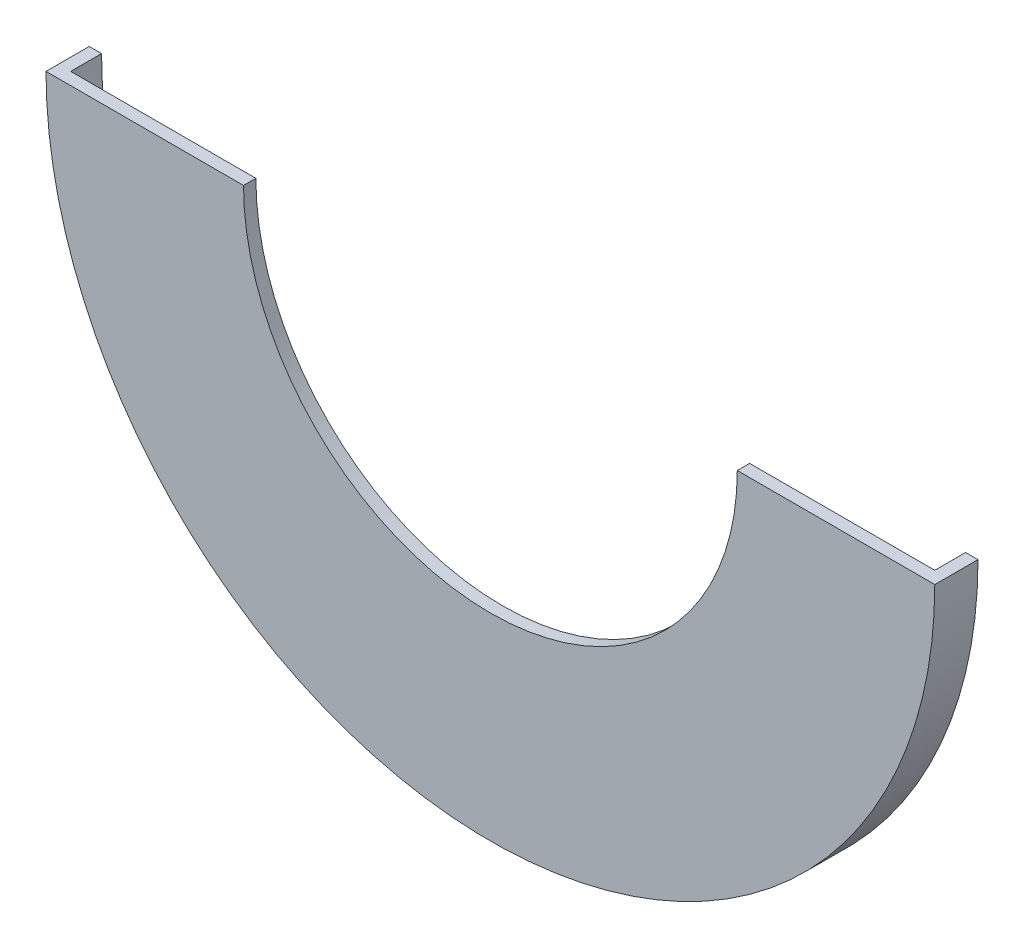
ISO-10303-21;
HEADER;
FILE_DESCRIPTION(('STEP AP214'),'2;1');
FILE_NAME('part.step','',(''),(''),'','','');
FILE_SCHEMA(('AUTOMOTIVE_DESIGN { 1 0 10303 214 1 1 1 1 }'));
ENDSEC;
DATA;
#1=APPLICATION_CONTEXT('core data for automotive mechanical design processes');
#2=APPLICATION_PROTOCOL_DEFINITION('international standard','automotive_design',2000,#1);
#3=PRODUCT_CONTEXT('',#1,'mechanical');
#4=PRODUCT('Part','Part','',(#3));
#5=PRODUCT_RELATED_PRODUCT_CATEGORY('part','',(#4));
#6=PRODUCT_DEFINITION_FORMATION('','',#4);
#7=PRODUCT_DEFINITION_CONTEXT('part definition',#1,'design');
#8=PRODUCT_DEFINITION('design','',#6,#7);
#9=PRODUCT_DEFINITION_SHAPE('','',#8);
#10=(LENGTH_UNIT() NAMED_UNIT(*) SI_UNIT(.MILLI.,.METRE.));
#11=(NAMED_UNIT(*) PLANE_ANGLE_UNIT() SI_UNIT($,.RADIAN.));
#12=(NAMED_UNIT(*) SI_UNIT($,.STERADIAN.) SOLID_ANGLE_UNIT());
#13=UNCERTAINTY_MEASURE_WITH_UNIT(LENGTH_MEASURE(1.E-05),#10,'distance_accuracy_value','');
#14=(GEOMETRIC_REPRESENTATION_CONTEXT(3) GLOBAL_UNCERTAINTY_ASSIGNED_CONTEXT((#13)) GLOBAL_UNIT_ASSIGNED_CONTEXT((#10,
#11,#12)) REPRESENTATION_CONTEXT('',''));
#15=CARTESIAN_POINT('',(0.,0.,0.));
#16=DIRECTION('',(0.,0.,1.));
#17=DIRECTION('',(1.,0.,0.));
#18=AXIS2_PLACEMENT_3D('',#15,#16,#17);
#19=CARTESIAN_POINT('',(0.,0.,5.));
#20=DIRECTION('',(0.,0.,-1.));
#21=DIRECTION('',(-1.,0.,0.));
#22=AXIS2_PLACEMENT_3D('',#19,#20,#21);
#23=CYLINDRICAL_SURFACE('',#22,70.);
#24=CARTESIAN_POINT('',(0.,0.,0.));
#25=DIRECTION('',(0.,0.,1.));
#26=DIRECTION('',(1.,0.,0.));
#27=AXIS2_PLACEMENT_3D('',#24,#25,#26);
#28=CIRCLE('',#27,70.);
#29=CARTESIAN_POINT('',(-70.,0.,0.));
#30=VERTEX_POINT('',#29);
#31=CARTESIAN_POINT('',(70.,0.,0.));
#32=VERTEX_POINT('',#31);
#33=EDGE_CURVE('E97',#30,#32,#28,.T.);
#34=ORIENTED_EDGE('',*,*,#33,.F.);
#35=DIRECTION('',(0.,0.,-1.));
#36=VECTOR('',#35,1.);
#37=CARTESIAN_POINT('',(-70.,0.,5.));
#38=LINE('',#37,#36);
#39=CARTESIAN_POINT('',(-70.,0.,5.));
#40=VERTEX_POINT('',#39);
#41=EDGE_CURVE('E11',#40,#30,#38,.T.);
#42=ORIENTED_EDGE('',*,*,#41,.F.);
#43=CARTESIAN_POINT('',(0.,0.,5.));
#44=DIRECTION('',(0.,0.,1.));
#45=DIRECTION('',(1.,0.,0.));
#46=AXIS2_PLACEMENT_3D('',#43,#44,#45);
#47=CIRCLE('',#46,70.);
#48=CARTESIAN_POINT('',(70.,0.,5.));
#49=VERTEX_POINT('',#48);
#50=EDGE_CURVE('E98',#40,#49,#47,.T.);
#51=ORIENTED_EDGE('',*,*,#50,.T.);
#52=DIRECTION('',(0.,0.,-1.));
#53=VECTOR('',#52,1.);
#54=CARTESIAN_POINT('',(70.,0.,5.));
#55=LINE('',#54,#53);
#56=EDGE_CURVE('E83',#49,#32,#55,.T.);
#57=ORIENTED_EDGE('',*,*,#56,.T.);
#58=EDGE_LOOP('',(#34,#42,#51,#57));
#59=FACE_BOUND('',#58,.T.);
#60=ADVANCED_FACE('F39',(#59),#23,.F.);
#61=CARTESIAN_POINT('',(0.,0.,5.));
#62=DIRECTION('',(0.,1.,0.));
#63=DIRECTION('',(-1.,0.,0.));
#64=AXIS2_PLACEMENT_3D('',#61,#62,#63);
#65=PLANE('',#64);
#66=DIRECTION('',(1.,0.,0.));
#67=VECTOR('',#66,1.);
#68=CARTESIAN_POINT('',(0.,0.,0.));
#69=LINE('',#68,#67);
#70=CARTESIAN_POINT('',(-72.,0.,0.));
#71=VERTEX_POINT('',#70);
#72=EDGE_CURVE('E92',#71,#30,#69,.T.);
#73=ORIENTED_EDGE('',*,*,#72,.F.);
#74=DIRECTION('',(0.,0.,-1.));
#75=VECTOR('',#74,1.);
#76=CARTESIAN_POINT('',(-72.,0.,5.));
#77=LINE('',#76,#75);
#78=CARTESIAN_POINT('',(-72.,0.,7.));
#79=VERTEX_POINT('',#78);
#80=EDGE_CURVE('E47',#79,#71,#77,.T.);
#81=ORIENTED_EDGE('',*,*,#80,.F.);
#82=DIRECTION('',(-1.,0.,0.));
#83=VECTOR('',#82,1.);
#84=CARTESIAN_POINT('',(0.,0.,7.));
#85=LINE('',#84,#83);
#86=CARTESIAN_POINT('',(-40.,0.,7.));
#87=VERTEX_POINT('',#86);
#88=EDGE_CURVE('E118',#87,#79,#85,.T.);
#89=ORIENTED_EDGE('',*,*,#88,.F.);
#90=DIRECTION('',(0.,0.,-1.));
#91=VECTOR('',#90,1.);
#92=CARTESIAN_POINT('',(-40.,0.,7.));
#93=LINE('',#92,#91);
#94=CARTESIAN_POINT('',(-40.,0.,5.));
#95=VERTEX_POINT('',#94);
#96=EDGE_CURVE('E105',#87,#95,#93,.T.);
#97=ORIENTED_EDGE('',*,*,#96,.T.);
#98=DIRECTION('',(-1.,0.,0.));
#99=VECTOR('',#98,1.);
#100=CARTESIAN_POINT('',(0.,0.,5.));
#101=LINE('',#100,#99);
#102=EDGE_CURVE('E111',#95,#40,#101,.T.);
#103=ORIENTED_EDGE('',*,*,#102,.T.);
#104=ORIENTED_EDGE('',*,*,#41,.T.);
#105=EDGE_LOOP('',(#73,#81,#89,#97,#103,#104));
#106=FACE_BOUND('',#105,.T.);
#107=ADVANCED_FACE('F141',(#106),#65,.T.);
#108=CARTESIAN_POINT('',(0.,0.,5.));
#109=DIRECTION('',(0.,0.,-1.));
#110=DIRECTION('',(-1.,0.,0.));
#111=AXIS2_PLACEMENT_3D('',#108,#109,#110);
#112=CYLINDRICAL_SURFACE('',#111,72.);
#113=CARTESIAN_POINT('',(0.,0.,0.));
#114=DIRECTION('',(0.,0.,1.));
#115=DIRECTION('',(1.,0.,0.));
#116=AXIS2_PLACEMENT_3D('',#113,#114,#115);
#117=CIRCLE('',#116,72.);
#118=CARTESIAN_POINT('',(72.,0.,0.));
#119=VERTEX_POINT('',#118);
#120=EDGE_CURVE('E86',#71,#119,#117,.T.);
#121=ORIENTED_EDGE('',*,*,#120,.T.);
#122=DIRECTION('',(0.,0.,-1.));
#123=VECTOR('',#122,1.);
#124=CARTESIAN_POINT('',(72.,0.,5.));
#125=LINE('',#124,#123);
#126=CARTESIAN_POINT('',(72.,0.,7.));
#127=VERTEX_POINT('',#126);
#128=EDGE_CURVE('E71',#127,#119,#125,.T.);
#129=ORIENTED_EDGE('',*,*,#128,.F.);
#130=CARTESIAN_POINT('',(0.,0.,7.));
#131=DIRECTION('',(0.,0.,1.));
#132=DIRECTION('',(1.,0.,0.));
#133=AXIS2_PLACEMENT_3D('',#130,#131,#132);
#134=CIRCLE('',#133,72.);
#135=EDGE_CURVE('E110',#79,#127,#134,.T.);
#136=ORIENTED_EDGE('',*,*,#135,.F.);
#137=ORIENTED_EDGE('',*,*,#80,.T.);
#138=EDGE_LOOP('',(#121,#129,#136,#137));
#139=FACE_BOUND('',#138,.T.);
#140=ADVANCED_FACE('F87',(#139),#112,.T.);
#141=EDGE_CURVE('E75',#32,#119,#69,.T.);
#142=ORIENTED_EDGE('',*,*,#141,.F.);
#143=ORIENTED_EDGE('',*,*,#56,.F.);
#144=DIRECTION('',(-1.,0.,0.));
#145=VECTOR('',#144,1.);
#146=CARTESIAN_POINT('',(0.,0.,5.));
#147=LINE('',#146,#145);
#148=CARTESIAN_POINT('',(40.,0.,5.));
#149=VERTEX_POINT('',#148);
#150=EDGE_CURVE('E54',#49,#149,#147,.T.);
#151=ORIENTED_EDGE('',*,*,#150,.T.);
#152=DIRECTION('',(0.,0.,-1.));
#153=VECTOR('',#152,1.);
#154=CARTESIAN_POINT('',(40.,0.,7.));
#155=LINE('',#154,#153);
#156=CARTESIAN_POINT('',(40.,0.,7.));
#157=VERTEX_POINT('',#156);
#158=EDGE_CURVE('E103',#157,#149,#155,.T.);
#159=ORIENTED_EDGE('',*,*,#158,.F.);
#160=DIRECTION('',(-1.,0.,0.));
#161=VECTOR('',#160,1.);
#162=CARTESIAN_POINT('',(0.,0.,7.));
#163=LINE('',#162,#161);
#164=EDGE_CURVE('E79',#127,#157,#163,.T.);
#165=ORIENTED_EDGE('',*,*,#164,.F.);
#166=ORIENTED_EDGE('',*,*,#128,.T.);
#167=EDGE_LOOP('',(#142,#143,#151,#159,#165,#166));
#168=FACE_BOUND('',#167,.T.);
#169=ADVANCED_FACE('F73',(#168),#65,.T.);
#170=CARTESIAN_POINT('',(0.,0.,0.));
#171=DIRECTION('',(0.,0.,1.));
#172=DIRECTION('',(1.,0.,0.));
#173=AXIS2_PLACEMENT_3D('',#170,#171,#172);
#174=PLANE('',#173);
#175=ORIENTED_EDGE('',*,*,#33,.T.);
#176=ORIENTED_EDGE('',*,*,#141,.T.);
#177=ORIENTED_EDGE('',*,*,#120,.F.);
#178=ORIENTED_EDGE('',*,*,#72,.T.);
#179=EDGE_LOOP('',(#175,#176,#177,#178));
#180=FACE_BOUND('',#179,.T.);
#181=ADVANCED_FACE('F95',(#180),#174,.F.);
#182=CARTESIAN_POINT('',(0.,0.,5.));
#183=DIRECTION('',(0.,0.,1.));
#184=DIRECTION('',(1.,0.,0.));
#185=AXIS2_PLACEMENT_3D('',#182,#183,#184);
#186=PLANE('',#185);
#187=ORIENTED_EDGE('',*,*,#50,.F.);
#188=ORIENTED_EDGE('',*,*,#102,.F.);
#189=CARTESIAN_POINT('',(0.,0.,5.));
#190=DIRECTION('',(0.,0.,1.));
#191=DIRECTION('',(1.,0.,0.));
#192=AXIS2_PLACEMENT_3D('',#189,#190,#191);
#193=CIRCLE('',#192,40.);
#194=EDGE_CURVE('E114',#95,#149,#193,.T.);
#195=ORIENTED_EDGE('',*,*,#194,.T.);
#196=ORIENTED_EDGE('',*,*,#150,.F.);
#197=EDGE_LOOP('',(#187,#188,#195,#196));
#198=FACE_BOUND('',#197,.T.);
#199=ADVANCED_FACE('F145',(#198),#186,.F.);
#200=CARTESIAN_POINT('',(0.,0.,7.));
#201=DIRECTION('',(0.,0.,-1.));
#202=DIRECTION('',(-1.,0.,0.));
#203=AXIS2_PLACEMENT_3D('',#200,#201,#202);
#204=CYLINDRICAL_SURFACE('',#203,40.);
#205=ORIENTED_EDGE('',*,*,#194,.F.);
#206=ORIENTED_EDGE('',*,*,#96,.F.);
#207=CARTESIAN_POINT('',(0.,0.,7.));
#208=DIRECTION('',(0.,0.,1.));
#209=DIRECTION('',(1.,0.,0.));
#210=AXIS2_PLACEMENT_3D('',#207,#208,#209);
#211=CIRCLE('',#210,40.);
#212=EDGE_CURVE('E121',#87,#157,#211,.T.);
#213=ORIENTED_EDGE('',*,*,#212,.T.);
#214=ORIENTED_EDGE('',*,*,#158,.T.);
#215=EDGE_LOOP('',(#205,#206,#213,#214));
#216=FACE_BOUND('',#215,.T.);
#217=ADVANCED_FACE('F135',(#216),#204,.F.);
#218=CARTESIAN_POINT('',(0.,0.,7.));
#219=DIRECTION('',(0.,0.,1.));
#220=DIRECTION('',(1.,0.,0.));
#221=AXIS2_PLACEMENT_3D('',#218,#219,#220);
#222=PLANE('',#221);
#223=ORIENTED_EDGE('',*,*,#164,.T.);
#224=ORIENTED_EDGE('',*,*,#212,.F.);
#225=ORIENTED_EDGE('',*,*,#88,.T.);
#226=ORIENTED_EDGE('',*,*,#135,.T.);
#227=EDGE_LOOP('',(#223,#224,#225,#226));
#228=FACE_BOUND('',#227,.T.);
#229=ADVANCED_FACE('F127',(#228),#222,.T.);
#230=CLOSED_SHELL('',(#60,#107,#140,#169,#181,#199,#217,#229));
#231=MANIFOLD_SOLID_BREP('B2',#230);
#232=ADVANCED_BREP_SHAPE_REPRESENTATION('',(#18,#231),#14);
#233=SHAPE_DEFINITION_REPRESENTATION(#9,#232);
ENDSEC;
END-ISO-10303-21;
